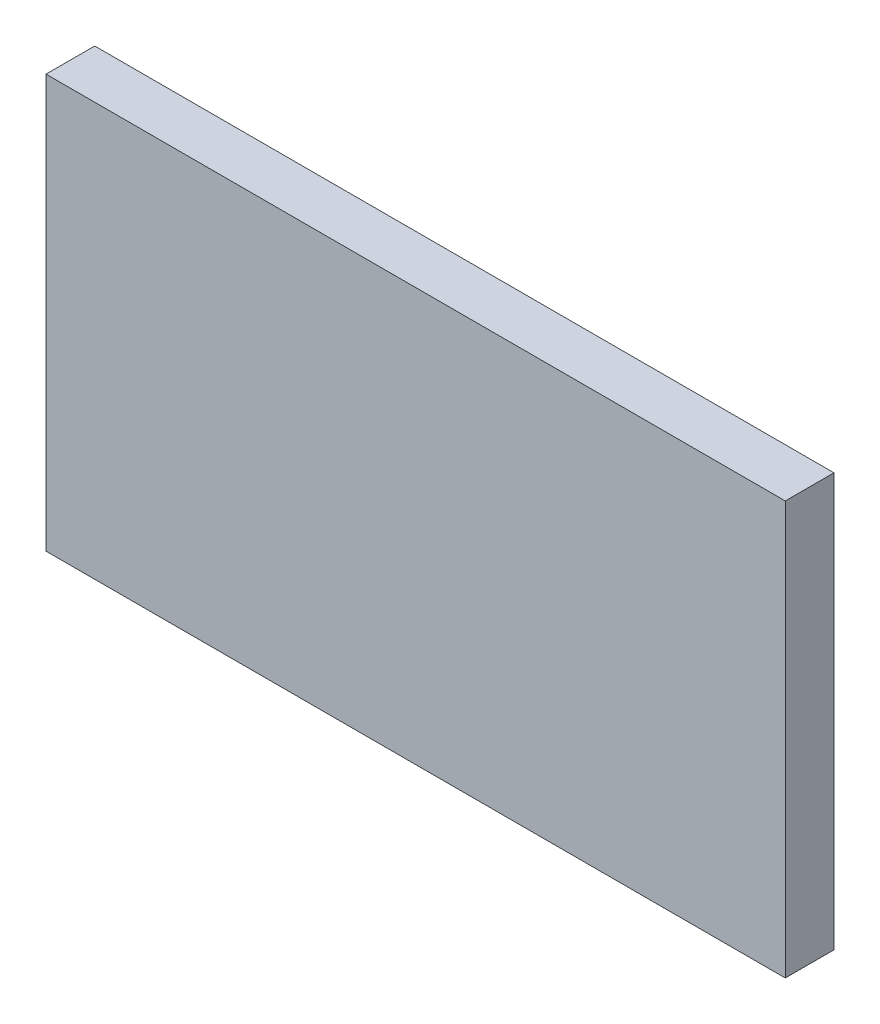
ISO-10303-21;
HEADER;
FILE_DESCRIPTION(('STEP AP214'),'2;1');
FILE_NAME('part.step','',(''),(''),'','','');
FILE_SCHEMA(('AUTOMOTIVE_DESIGN { 1 0 10303 214 1 1 1 1 }'));
ENDSEC;
DATA;
#1=APPLICATION_CONTEXT('core data for automotive mechanical design processes');
#2=APPLICATION_PROTOCOL_DEFINITION('international standard','automotive_design',2000,#1);
#3=PRODUCT_CONTEXT('',#1,'mechanical');
#4=PRODUCT('Part','Part','',(#3));
#5=PRODUCT_RELATED_PRODUCT_CATEGORY('part','',(#4));
#6=PRODUCT_DEFINITION_FORMATION('','',#4);
#7=PRODUCT_DEFINITION_CONTEXT('part definition',#1,'design');
#8=PRODUCT_DEFINITION('design','',#6,#7);
#9=PRODUCT_DEFINITION_SHAPE('','',#8);
#10=(LENGTH_UNIT() NAMED_UNIT(*) SI_UNIT(.MILLI.,.METRE.));
#11=(NAMED_UNIT(*) PLANE_ANGLE_UNIT() SI_UNIT($,.RADIAN.));
#12=(NAMED_UNIT(*) SI_UNIT($,.STERADIAN.) SOLID_ANGLE_UNIT());
#13=UNCERTAINTY_MEASURE_WITH_UNIT(LENGTH_MEASURE(1.E-05),#10,'distance_accuracy_value','');
#14=(GEOMETRIC_REPRESENTATION_CONTEXT(3) GLOBAL_UNCERTAINTY_ASSIGNED_CONTEXT((#13)) GLOBAL_UNIT_ASSIGNED_CONTEXT((#10,
#11,#12)) REPRESENTATION_CONTEXT('',''));
#15=CARTESIAN_POINT('',(0.,0.,0.));
#16=DIRECTION('',(0.,0.,1.));
#17=DIRECTION('',(1.,0.,0.));
#18=AXIS2_PLACEMENT_3D('',#15,#16,#17);
#19=CARTESIAN_POINT('',(0.694938762168119,-0.69210098538943,0.));
#20=DIRECTION('',(0.,-1.,0.));
#21=DIRECTION('',(1.,0.,0.));
#22=AXIS2_PLACEMENT_3D('',#19,#20,#21);
#23=PLANE('',#22);
#24=DIRECTION('',(1.,0.,0.));
#25=VECTOR('',#24,1.);
#26=CARTESIAN_POINT('',(0.694938762168119,-0.69210098538943,0.));
#27=LINE('',#26,#25);
#28=CARTESIAN_POINT('',(0.694938762168119,-0.69210098538943,0.));
#29=VERTEX_POINT('',#28);
#30=CARTESIAN_POINT('',(0.740468540230095,-0.69210098538943,0.));
#31=VERTEX_POINT('',#30);
#32=EDGE_CURVE('E11',#29,#31,#27,.T.);
#33=ORIENTED_EDGE('',*,*,#32,.T.);
#34=DIRECTION('',(0.,0.,1.));
#35=VECTOR('',#34,1.);
#36=CARTESIAN_POINT('',(0.740468540230095,-0.69210098538943,0.));
#37=LINE('',#36,#35);
#38=CARTESIAN_POINT('',(0.740468540230095,-0.69210098538943,0.003));
#39=VERTEX_POINT('',#38);
#40=EDGE_CURVE('E24',#31,#39,#37,.T.);
#41=ORIENTED_EDGE('',*,*,#40,.T.);
#42=DIRECTION('',(1.,0.,0.));
#43=VECTOR('',#42,1.);
#44=CARTESIAN_POINT('',(0.694938762168119,-0.69210098538943,0.003));
#45=LINE('',#44,#43);
#46=CARTESIAN_POINT('',(0.694938762168119,-0.69210098538943,0.003));
#47=VERTEX_POINT('',#46);
#48=EDGE_CURVE('E75',#47,#39,#45,.T.);
#49=ORIENTED_EDGE('',*,*,#48,.F.);
#50=DIRECTION('',(0.,0.,1.));
#51=VECTOR('',#50,1.);
#52=CARTESIAN_POINT('',(0.694938762168119,-0.69210098538943,0.));
#53=LINE('',#52,#51);
#54=EDGE_CURVE('E86',#29,#47,#53,.T.);
#55=ORIENTED_EDGE('',*,*,#54,.F.);
#56=EDGE_LOOP('',(#33,#41,#49,#55));
#57=FACE_BOUND('',#56,.T.);
#58=ADVANCED_FACE('F17',(#57),#23,.T.);
#59=CARTESIAN_POINT('',(0.694938762168119,-0.666654517951279,0.));
#60=DIRECTION('',(-1.,0.,0.));
#61=DIRECTION('',(0.,-1.,0.));
#62=AXIS2_PLACEMENT_3D('',#59,#60,#61);
#63=PLANE('',#62);
#64=DIRECTION('',(0.,-1.,0.));
#65=VECTOR('',#64,1.);
#66=CARTESIAN_POINT('',(0.694938762168119,-0.666654517951279,0.));
#67=LINE('',#66,#65);
#68=CARTESIAN_POINT('',(0.694938762168119,-0.666654517951279,0.));
#69=VERTEX_POINT('',#68);
#70=EDGE_CURVE('E83',#69,#29,#67,.T.);
#71=ORIENTED_EDGE('',*,*,#70,.T.);
#72=ORIENTED_EDGE('',*,*,#54,.T.);
#73=DIRECTION('',(0.,-1.,0.));
#74=VECTOR('',#73,1.);
#75=CARTESIAN_POINT('',(0.694938762168119,-0.666654517951279,0.003));
#76=LINE('',#75,#74);
#77=CARTESIAN_POINT('',(0.694938762168119,-0.666654517951279,0.003));
#78=VERTEX_POINT('',#77);
#79=EDGE_CURVE('E81',#78,#47,#76,.T.);
#80=ORIENTED_EDGE('',*,*,#79,.F.);
#81=DIRECTION('',(0.,0.,1.));
#82=VECTOR('',#81,1.);
#83=CARTESIAN_POINT('',(0.694938762168119,-0.666654517951279,0.));
#84=LINE('',#83,#82);
#85=EDGE_CURVE('E61',#69,#78,#84,.T.);
#86=ORIENTED_EDGE('',*,*,#85,.F.);
#87=EDGE_LOOP('',(#71,#72,#80,#86));
#88=FACE_BOUND('',#87,.T.);
#89=ADVANCED_FACE('F91',(#88),#63,.T.);
#90=CARTESIAN_POINT('',(0.740468540230095,-0.666654517951279,0.));
#91=DIRECTION('',(0.,1.,0.));
#92=DIRECTION('',(-1.,0.,0.));
#93=AXIS2_PLACEMENT_3D('',#90,#91,#92);
#94=PLANE('',#93);
#95=DIRECTION('',(-1.,0.,0.));
#96=VECTOR('',#95,1.);
#97=CARTESIAN_POINT('',(0.740468540230095,-0.666654517951279,0.));
#98=LINE('',#97,#96);
#99=CARTESIAN_POINT('',(0.740468540230095,-0.666654517951279,0.));
#100=VERTEX_POINT('',#99);
#101=EDGE_CURVE('E65',#100,#69,#98,.T.);
#102=ORIENTED_EDGE('',*,*,#101,.T.);
#103=ORIENTED_EDGE('',*,*,#85,.T.);
#104=DIRECTION('',(-1.,0.,0.));
#105=VECTOR('',#104,1.);
#106=CARTESIAN_POINT('',(0.740468540230095,-0.666654517951279,0.003));
#107=LINE('',#106,#105);
#108=CARTESIAN_POINT('',(0.740468540230095,-0.666654517951279,0.003));
#109=VERTEX_POINT('',#108);
#110=EDGE_CURVE('E54',#109,#78,#107,.T.);
#111=ORIENTED_EDGE('',*,*,#110,.F.);
#112=DIRECTION('',(0.,0.,1.));
#113=VECTOR('',#112,1.);
#114=CARTESIAN_POINT('',(0.740468540230095,-0.666654517951279,0.));
#115=LINE('',#114,#113);
#116=EDGE_CURVE('E58',#100,#109,#115,.T.);
#117=ORIENTED_EDGE('',*,*,#116,.F.);
#118=EDGE_LOOP('',(#102,#103,#111,#117));
#119=FACE_BOUND('',#118,.T.);
#120=ADVANCED_FACE('F57',(#119),#94,.T.);
#121=CARTESIAN_POINT('',(0.740468540230095,-0.69210098538943,0.));
#122=DIRECTION('',(1.,0.,0.));
#123=DIRECTION('',(0.,1.,0.));
#124=AXIS2_PLACEMENT_3D('',#121,#122,#123);
#125=PLANE('',#124);
#126=DIRECTION('',(0.,1.,0.));
#127=VECTOR('',#126,1.);
#128=CARTESIAN_POINT('',(0.740468540230095,-0.69210098538943,0.));
#129=LINE('',#128,#127);
#130=EDGE_CURVE('E71',#31,#100,#129,.T.);
#131=ORIENTED_EDGE('',*,*,#130,.T.);
#132=ORIENTED_EDGE('',*,*,#116,.T.);
#133=DIRECTION('',(0.,1.,0.));
#134=VECTOR('',#133,1.);
#135=CARTESIAN_POINT('',(0.740468540230095,-0.69210098538943,0.003));
#136=LINE('',#135,#134);
#137=EDGE_CURVE('E70',#39,#109,#136,.T.);
#138=ORIENTED_EDGE('',*,*,#137,.F.);
#139=ORIENTED_EDGE('',*,*,#40,.F.);
#140=EDGE_LOOP('',(#131,#132,#138,#139));
#141=FACE_BOUND('',#140,.T.);
#142=ADVANCED_FACE('F69',(#141),#125,.T.);
#143=CARTESIAN_POINT('',(0.717703651199107,-0.679377751670355,0.003));
#144=DIRECTION('',(0.,0.,1.));
#145=DIRECTION('',(1.,0.,0.));
#146=AXIS2_PLACEMENT_3D('',#143,#144,#145);
#147=PLANE('',#146);
#148=ORIENTED_EDGE('',*,*,#137,.T.);
#149=ORIENTED_EDGE('',*,*,#110,.T.);
#150=ORIENTED_EDGE('',*,*,#79,.T.);
#151=ORIENTED_EDGE('',*,*,#48,.T.);
#152=EDGE_LOOP('',(#148,#149,#150,#151));
#153=FACE_BOUND('',#152,.T.);
#154=ADVANCED_FACE('F74',(#153),#147,.T.);
#155=CARTESIAN_POINT('',(0.717703651199107,-0.679377751670355,0.));
#156=DIRECTION('',(0.,0.,1.));
#157=DIRECTION('',(1.,0.,0.));
#158=AXIS2_PLACEMENT_3D('',#155,#156,#157);
#159=PLANE('',#158);
#160=ORIENTED_EDGE('',*,*,#130,.F.);
#161=ORIENTED_EDGE('',*,*,#32,.F.);
#162=ORIENTED_EDGE('',*,*,#70,.F.);
#163=ORIENTED_EDGE('',*,*,#101,.F.);
#164=EDGE_LOOP('',(#160,#161,#162,#163));
#165=FACE_BOUND('',#164,.T.);
#166=ADVANCED_FACE('F89',(#165),#159,.F.);
#167=CLOSED_SHELL('',(#58,#89,#120,#142,#154,#166));
#168=MANIFOLD_SOLID_BREP('B1',#167);
#169=ADVANCED_BREP_SHAPE_REPRESENTATION('',(#18,#168),#14);
#170=SHAPE_DEFINITION_REPRESENTATION(#9,#169);
ENDSEC;
END-ISO-10303-21;
